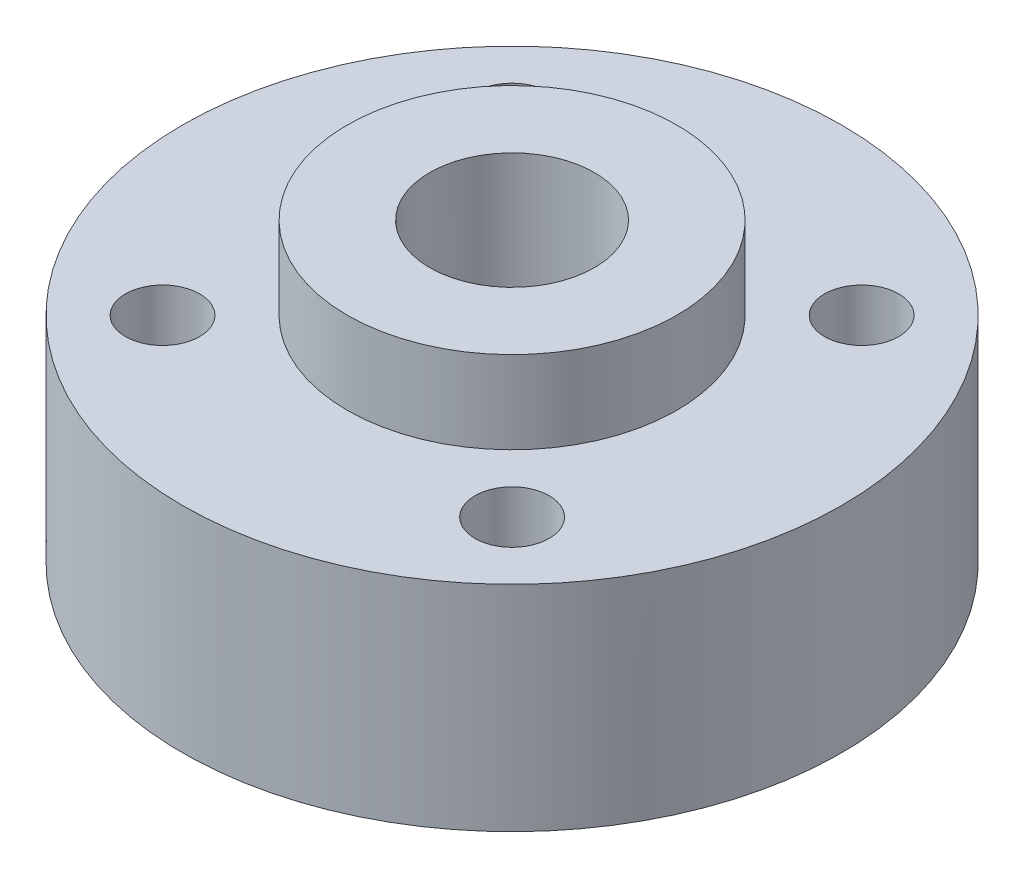
ISO-10303-21;
HEADER;
FILE_DESCRIPTION(('STEP AP214'),'2;1');
FILE_NAME('part.step','',(''),(''),'','','');
FILE_SCHEMA(('AUTOMOTIVE_DESIGN { 1 0 10303 214 1 1 1 1 }'));
ENDSEC;
DATA;
#1=APPLICATION_CONTEXT('core data for automotive mechanical design processes');
#2=APPLICATION_PROTOCOL_DEFINITION('international standard','automotive_design',2000,#1);
#3=PRODUCT_CONTEXT('',#1,'mechanical');
#4=PRODUCT('Part','Part','',(#3));
#5=PRODUCT_RELATED_PRODUCT_CATEGORY('part','',(#4));
#6=PRODUCT_DEFINITION_FORMATION('','',#4);
#7=PRODUCT_DEFINITION_CONTEXT('part definition',#1,'design');
#8=PRODUCT_DEFINITION('design','',#6,#7);
#9=PRODUCT_DEFINITION_SHAPE('','',#8);
#10=(LENGTH_UNIT() NAMED_UNIT(*) SI_UNIT(.MILLI.,.METRE.));
#11=(NAMED_UNIT(*) PLANE_ANGLE_UNIT() SI_UNIT($,.RADIAN.));
#12=(NAMED_UNIT(*) SI_UNIT($,.STERADIAN.) SOLID_ANGLE_UNIT());
#13=UNCERTAINTY_MEASURE_WITH_UNIT(LENGTH_MEASURE(1.E-05),#10,'distance_accuracy_value','');
#14=(GEOMETRIC_REPRESENTATION_CONTEXT(3) GLOBAL_UNCERTAINTY_ASSIGNED_CONTEXT((#13)) GLOBAL_UNIT_ASSIGNED_CONTEXT((#10,
#11,#12)) REPRESENTATION_CONTEXT('',''));
#15=CARTESIAN_POINT('',(0.,0.,0.));
#16=DIRECTION('',(0.,0.,1.));
#17=DIRECTION('',(1.,0.,0.));
#18=AXIS2_PLACEMENT_3D('',#15,#16,#17);
#19=CARTESIAN_POINT('',(0.,7.5,0.));
#20=DIRECTION('',(0.,1.,0.));
#21=DIRECTION('',(0.,0.,1.));
#22=AXIS2_PLACEMENT_3D('',#19,#20,#21);
#23=PLANE('',#22);
#24=CARTESIAN_POINT('',(0.,7.5,0.));
#25=DIRECTION('',(0.,1.,0.));
#26=DIRECTION('',(0.,0.,1.));
#27=AXIS2_PLACEMENT_3D('',#24,#25,#26);
#28=CIRCLE('',#27,20.);
#29=CARTESIAN_POINT('',(0.,7.5,20.));
#30=VERTEX_POINT('',#29);
#31=EDGE_CURVE('E10',#30,#30,#28,.T.);
#32=ORIENTED_EDGE('',*,*,#31,.T.);
#33=EDGE_LOOP('',(#32));
#34=FACE_BOUND('',#33,.T.);
#35=CARTESIAN_POINT('',(-10.6066017177982,7.5,-10.6066017177982));
#36=DIRECTION('',(0.,1.,0.));
#37=DIRECTION('',(0.,0.,1.));
#38=AXIS2_PLACEMENT_3D('',#35,#36,#37);
#39=CIRCLE('',#38,2.25);
#40=CARTESIAN_POINT('',(-10.6066017177982,7.5,-8.35660171779819));
#41=VERTEX_POINT('',#40);
#42=EDGE_CURVE('E88',#41,#41,#39,.T.);
#43=ORIENTED_EDGE('',*,*,#42,.F.);
#44=EDGE_LOOP('',(#43));
#45=FACE_BOUND('',#44,.T.);
#46=CARTESIAN_POINT('',(10.6066017177981,7.5,-10.6066017177983));
#47=DIRECTION('',(0.,1.,0.));
#48=DIRECTION('',(-1.,0.,0.));
#49=AXIS2_PLACEMENT_3D('',#46,#47,#48);
#50=CIRCLE('',#49,2.25);
#51=CARTESIAN_POINT('',(8.35660171779808,7.5,-10.6066017177983));
#52=VERTEX_POINT('',#51);
#53=EDGE_CURVE('E81',#52,#52,#50,.T.);
#54=ORIENTED_EDGE('',*,*,#53,.F.);
#55=EDGE_LOOP('',(#54));
#56=FACE_BOUND('',#55,.T.);
#57=CARTESIAN_POINT('',(10.6066017177982,7.5,10.6066017177982));
#58=DIRECTION('',(0.,1.,0.));
#59=DIRECTION('',(0.,0.,-1.));
#60=AXIS2_PLACEMENT_3D('',#57,#58,#59);
#61=CIRCLE('',#60,2.25);
#62=CARTESIAN_POINT('',(10.6066017177982,7.5,8.35660171779819));
#63=VERTEX_POINT('',#62);
#64=EDGE_CURVE('E95',#63,#63,#61,.T.);
#65=ORIENTED_EDGE('',*,*,#64,.F.);
#66=EDGE_LOOP('',(#65));
#67=FACE_BOUND('',#66,.T.);
#68=CARTESIAN_POINT('',(-10.6066017177982,7.5,10.6066017177983));
#69=DIRECTION('',(0.,1.,0.));
#70=DIRECTION('',(1.,0.,0.));
#71=AXIS2_PLACEMENT_3D('',#68,#69,#70);
#72=CIRCLE('',#71,2.25);
#73=CARTESIAN_POINT('',(-8.35660171779816,7.5,10.6066017177983));
#74=VERTEX_POINT('',#73);
#75=EDGE_CURVE('E89',#74,#74,#72,.T.);
#76=ORIENTED_EDGE('',*,*,#75,.F.);
#77=EDGE_LOOP('',(#76));
#78=FACE_BOUND('',#77,.T.);
#79=CARTESIAN_POINT('',(0.,7.5,0.));
#80=DIRECTION('',(0.,1.,0.));
#81=DIRECTION('',(0.,0.,1.));
#82=AXIS2_PLACEMENT_3D('',#79,#80,#81);
#83=CIRCLE('',#82,10.);
#84=CARTESIAN_POINT('',(0.,7.5,10.));
#85=VERTEX_POINT('',#84);
#86=EDGE_CURVE('E120',#85,#85,#83,.T.);
#87=ORIENTED_EDGE('',*,*,#86,.F.);
#88=EDGE_LOOP('',(#87));
#89=FACE_BOUND('',#88,.T.);
#90=ADVANCED_FACE('F30',(#34,#45,#56,#67,#78,#89),#23,.T.);
#91=CARTESIAN_POINT('',(0.,-7.5,0.));
#92=DIRECTION('',(0.,1.,0.));
#93=DIRECTION('',(0.,0.,1.));
#94=AXIS2_PLACEMENT_3D('',#91,#92,#93);
#95=PLANE('',#94);
#96=CARTESIAN_POINT('',(0.,-7.5,0.));
#97=DIRECTION('',(0.,1.,0.));
#98=DIRECTION('',(0.,0.,1.));
#99=AXIS2_PLACEMENT_3D('',#96,#97,#98);
#100=CIRCLE('',#99,5.);
#101=CARTESIAN_POINT('',(0.,-7.5,5.));
#102=VERTEX_POINT('',#101);
#103=EDGE_CURVE('E39',#102,#102,#100,.T.);
#104=ORIENTED_EDGE('',*,*,#103,.T.);
#105=EDGE_LOOP('',(#104));
#106=FACE_BOUND('',#105,.T.);
#107=CARTESIAN_POINT('',(0.,-7.5,0.));
#108=DIRECTION('',(0.,-1.,0.));
#109=DIRECTION('',(0.,0.,-1.));
#110=AXIS2_PLACEMENT_3D('',#107,#108,#109);
#111=CIRCLE('',#110,10.);
#112=CARTESIAN_POINT('',(0.,-7.5,-10.));
#113=VERTEX_POINT('',#112);
#114=EDGE_CURVE('E126',#113,#113,#111,.T.);
#115=ORIENTED_EDGE('',*,*,#114,.T.);
#116=EDGE_LOOP('',(#115));
#117=FACE_BOUND('',#116,.T.);
#118=ADVANCED_FACE('F111',(#106,#117),#95,.F.);
#119=CARTESIAN_POINT('',(0.,7.5,0.));
#120=DIRECTION('',(0.,-1.,0.));
#121=DIRECTION('',(0.,0.,-1.));
#122=AXIS2_PLACEMENT_3D('',#119,#120,#121);
#123=CYLINDRICAL_SURFACE('',#122,20.);
#124=ORIENTED_EDGE('',*,*,#31,.F.);
#125=EDGE_LOOP('',(#124));
#126=FACE_BOUND('',#125,.T.);
#127=CARTESIAN_POINT('',(0.,2.25,-20.));
#128=CARTESIAN_POINT('',(-0.12595653422754,2.24999459165418,-19.9999983916896));
#129=CARTESIAN_POINT('',(-0.251994190121903,2.23938766603984,-19.9987975140792));
#130=CARTESIAN_POINT('',(-0.500569129819927,2.19723813548911,-19.9941224661232));
#131=CARTESIAN_POINT('',(-0.623102504576185,2.16567303420946,-19.9906458530775));
#132=CARTESIAN_POINT('',(-0.861033738412179,2.08254301798447,-19.98181140957));
#133=CARTESIAN_POINT('',(-0.976436087007576,2.03099083824956,-19.9764547772098));
#134=CARTESIAN_POINT('',(-1.19692694189212,1.90937629489067,-19.964457745396));
#135=CARTESIAN_POINT('',(-1.3020173604729,1.8393173721729,-19.9578175846468));
#136=CARTESIAN_POINT('',(-1.49939790756792,1.68234029759234,-19.9439627363684));
#137=CARTESIAN_POINT('',(-1.59163499909242,1.59535564531887,-19.9367458510751));
#138=CARTESIAN_POINT('',(-1.76023429925169,1.40713868555006,-19.9225688974834));
#139=CARTESIAN_POINT('',(-1.83659573935264,1.30590568869578,-19.9156088416313));
#140=CARTESIAN_POINT('',(-1.97146895296656,1.09172718781443,-19.9027116079686));
#141=CARTESIAN_POINT('',(-2.02993186891103,0.978750732715221,-19.896777248869));
#142=CARTESIAN_POINT('',(-2.12703651216175,0.744506032493647,-19.8866315278854));
#143=CARTESIAN_POINT('',(-2.16567885208601,0.623238043778851,-19.882420112749));
#144=CARTESIAN_POINT('',(-2.22188616663361,0.376398638788323,-19.8762176047277));
#145=CARTESIAN_POINT('',(-2.23953995188614,0.250847684438009,-19.8742171589324));
#146=CARTESIAN_POINT('',(-2.25354369576188,-0.00144973877291306,-19.872634280748));
#147=CARTESIAN_POINT('',(-2.24989435414666,-0.128196168228214,-19.8730517689351));
#148=CARTESIAN_POINT('',(-2.22146849070042,-0.378671308449509,-19.8762490345589));
#149=CARTESIAN_POINT('',(-2.19678934102239,-0.502411228380636,-19.879017924342));
#150=CARTESIAN_POINT('',(-2.1271561175811,-0.743981836045423,-19.8865890205414));
#151=CARTESIAN_POINT('',(-2.08220170484526,-0.861812424947161,-19.8913912609523));
#152=CARTESIAN_POINT('',(-1.97318790208164,-1.08852478132344,-19.9025004195946));
#153=CARTESIAN_POINT('',(-1.90908573138459,-1.19738580637386,-19.9088107007699));
#154=CARTESIAN_POINT('',(-1.76362671110957,-1.40284174421491,-19.9222222173786));
#155=CARTESIAN_POINT('',(-1.68226922194342,-1.49943620211893,-19.9293234821262));
#156=CARTESIAN_POINT('',(-1.50406714512458,-1.67818256707793,-19.9435653095352));
#157=CARTESIAN_POINT('',(-1.40713854088213,-1.7602507368131,-19.9507058700096));
#158=CARTESIAN_POINT('',(-1.20083625225702,-1.90696448435295,-19.9641844277881));
#159=CARTESIAN_POINT('',(-1.09146254766764,-1.97161003386849,-19.970522423789));
#160=CARTESIAN_POINT('',(-0.86331365850418,-2.08164174517799,-19.9816846488748));
#161=CARTESIAN_POINT('',(-0.74453617914061,-2.12702318868538,-19.986508507032));
#162=CARTESIAN_POINT('',(-0.5009808307105,-2.19717469974177,-19.994095382619));
#163=CARTESIAN_POINT('',(-0.376203189127312,-2.22194554804684,-19.9968584781127));
#164=CARTESIAN_POINT('',(-0.124914122086498,-2.25006539878771,-20.000002422939));
#165=CARTESIAN_POINT('',(0.00158422939712101,-2.25352985771116,-20.0003961115233));
#166=CARTESIAN_POINT('',(0.253359714887554,-2.23924251414208,-19.998791425042));
#167=CARTESIAN_POINT('',(0.378636869829028,-2.22149107599537,-19.9967930910553));
#168=CARTESIAN_POINT('',(0.624077049682717,-2.16537168696439,-19.9906369945286));
#169=CARTESIAN_POINT('',(0.74425269794097,-2.12705826495014,-19.9864849444559));
#170=CARTESIAN_POINT('',(0.976472099187427,-2.03095883128837,-19.9764867440531));
#171=CARTESIAN_POINT('',(1.08851562463143,-1.97317227501991,-19.9706405463419));
#172=CARTESIAN_POINT('',(1.30180928914228,-1.8394838971492,-19.9578749174881));
#173=CARTESIAN_POINT('',(1.40301196039062,-1.76350677172692,-19.9509510680054));
#174=CARTESIAN_POINT('',(1.59126949406033,-1.59570125570931,-19.9368199725166));
#175=CARTESIAN_POINT('',(1.67832390452276,-1.50387235893042,-19.9296127174665));
#176=CARTESIAN_POINT('',(1.83621879743148,-1.30646390591937,-19.9156880079027));
#177=CARTESIAN_POINT('',(1.90698314176443,-1.20082325826826,-19.9089729495644));
#178=CARTESIAN_POINT('',(2.02976454018774,-0.979089053883812,-19.8968308698045));
#179=CARTESIAN_POINT('',(2.08178190837407,-0.862995672321404,-19.8914038268034));
#180=CARTESIAN_POINT('',(2.16546728299968,-0.623905260887279,-19.8824679266496));
#181=CARTESIAN_POINT('',(2.19717946602248,-0.500923855589978,-19.8789549077887));
#182=CARTESIAN_POINT('',(2.23949713178096,-0.251339905733451,-19.8742323958419));
#183=CARTESIAN_POINT('',(2.250103396302,-0.124737495476262,-19.8730228174341));
#184=CARTESIAN_POINT('',(2.24989565842773,0.127737640010851,-19.8730462777696));
#185=CARTESIAN_POINT('',(2.23920125785514,0.253610481841064,-19.8742656779627));
#186=CARTESIAN_POINT('',(2.19694771835504,0.501758474941963,-19.8789805075552));
#187=CARTESIAN_POINT('',(2.16538856505871,0.624033623734983,-19.882475938522));
#188=CARTESIAN_POINT('',(2.08233649924143,0.861507280631521,-19.8913449966611));
#189=CARTESIAN_POINT('',(2.03084818053867,0.976707412492701,-19.8967181909675));
#190=CARTESIAN_POINT('',(1.90941130191561,1.19685077880024,-19.9087381590707));
#191=CARTESIAN_POINT('',(1.83946268594876,1.30179398210462,-19.9153849367341));
#192=CARTESIAN_POINT('',(1.68264381218864,1.49905700988164,-19.9292478989181));
#193=CARTESIAN_POINT('',(1.59568433965112,1.59130571212968,-19.936466960647));
#194=CARTESIAN_POINT('',(1.40749468127853,1.75995013727221,-19.950635162213));
#195=CARTESIAN_POINT('',(1.30626110896857,1.83634208755078,-19.9575842374964));
#196=CARTESIAN_POINT('',(1.09204274654609,1.97130007089213,-19.9704527625105));
#197=CARTESIAN_POINT('',(0.979022359287405,2.02980987711342,-19.9763689399996));
#198=CARTESIAN_POINT('',(0.744761992830465,2.12693976233983,-19.9864708944833));
#199=CARTESIAN_POINT('',(0.623531292595019,2.1655818840901,-19.9906585881692));
#200=CARTESIAN_POINT('',(0.418034465927811,2.21242530738788,-19.9957995892954));
#201=CARTESIAN_POINT('',(0.33507403916056,2.22649609794949,-19.9973672439623));
#202=CARTESIAN_POINT('',(0.168087781707914,2.2452852229585,-19.999467983119));
#203=CARTESIAN_POINT('',(0.0840619569559497,2.25000360946843,-20.0000010733681));
#204=CARTESIAN_POINT('',(0.,2.25,-20.));
#205=B_SPLINE_CURVE_WITH_KNOTS('',3,(#127,#128,#129,#130,#131,#132,#133,#134,#135,#136,#137,
#138,#139,#140,#141,#142,#143,#144,#145,#146,#147,#148,#149,#150,#151,#152,#153,#154,#155,#156,
#157,#158,#159,#160,#161,#162,#163,#164,#165,#166,#167,#168,#169,#170,#171,#172,#173,#174,#175,
#176,#177,#178,#179,#180,#181,#182,#183,#184,#185,#186,#187,#188,#189,#190,#191,#192,#193,#194,
#195,#196,#197,#198,#199,#200,#201,#202,#203,#204),.UNSPECIFIED.,.T.,.F.,(4,2,2,2,2,2,2,2,2,2,2,
2,2,2,2,2,2,2,2,2,2,2,2,2,2,2,2,2,2,2,2,2,2,2,2,2,2,2,4),(0.,0.377562598674401,
0.755531126712053,1.13325921846395,1.51091712967437,1.89008994631748,2.26928111429069,
2.64949831582188,3.02970376482131,3.40829462693554,3.78687305322994,4.16370805251873,
4.54054935216792,4.9182389843696,5.29594261851797,5.67575725262566,6.05557250343523,
6.43548072739601,6.81537455928535,7.19320797007885,7.57103489233969,7.94786476098357,
8.32470516960885,8.70313341812505,9.08157375296244,9.46174850655045,9.84191689020943,
10.221255331996,10.6005797224272,10.9777802356733,11.3549810086843,11.7320948858927,
12.1092099080543,12.488358495692,12.8675971866894,13.2480163330257,13.628012497197,
13.879994879813,14.1319758597009),.UNSPECIFIED.);
#206=CARTESIAN_POINT('',(0.,2.25,-20.));
#207=VERTEX_POINT('',#206);
#208=EDGE_CURVE('E54',#207,#207,#205,.T.);
#209=ORIENTED_EDGE('',*,*,#208,.T.);
#210=EDGE_LOOP('',(#209));
#211=FACE_BOUND('',#210,.T.);
#212=CARTESIAN_POINT('',(-20.0000000000001,-2.25,0.));
#213=CARTESIAN_POINT('',(-19.9999983916897,-2.24999459165418,-0.125956534227469));
#214=CARTESIAN_POINT('',(-19.9987975140793,-2.23938766603984,-0.251994190121832));
#215=CARTESIAN_POINT('',(-19.9941224661232,-2.19723813548911,-0.500569129819856));
#216=CARTESIAN_POINT('',(-19.9906458530775,-2.16567303420946,-0.623102504576114));
#217=CARTESIAN_POINT('',(-19.98181140957,-2.08254301798448,-0.861033738412108));
#218=CARTESIAN_POINT('',(-19.9764547772098,-2.03099083824956,-0.976436087007505));
#219=CARTESIAN_POINT('',(-19.964457745396,-1.90937629489067,-1.19692694189204));
#220=CARTESIAN_POINT('',(-19.9578175846468,-1.8393173721729,-1.30201736047283));
#221=CARTESIAN_POINT('',(-19.9439627363684,-1.68234029759234,-1.49939790756785));
#222=CARTESIAN_POINT('',(-19.9367458510751,-1.59535564531887,-1.59163499909235));
#223=CARTESIAN_POINT('',(-19.9225688974834,-1.40713868555006,-1.76023429925162));
#224=CARTESIAN_POINT('',(-19.9156088416313,-1.30590568869579,-1.83659573935257));
#225=CARTESIAN_POINT('',(-19.9027116079686,-1.09172718781444,-1.97146895296649));
#226=CARTESIAN_POINT('',(-19.896777248869,-0.978750732715224,-2.02993186891096));
#227=CARTESIAN_POINT('',(-19.8866315278854,-0.744506032493649,-2.12703651216168));
#228=CARTESIAN_POINT('',(-19.882420112749,-0.623238043778853,-2.16567885208594));
#229=CARTESIAN_POINT('',(-19.8762176047278,-0.376398638788325,-2.22188616663354));
#230=CARTESIAN_POINT('',(-19.8742171589324,-0.250847684438011,-2.23953995188607));
#231=CARTESIAN_POINT('',(-19.872634280748,0.00144973877291076,-2.25354369576181));
#232=CARTESIAN_POINT('',(-19.8730517689351,0.128196168228212,-2.24989435414659));
#233=CARTESIAN_POINT('',(-19.8762490345589,0.378671308449506,-2.22146849070035));
#234=CARTESIAN_POINT('',(-19.879017924342,0.502411228380634,-2.19678934102232));
#235=CARTESIAN_POINT('',(-19.8865890205414,0.743981836045421,-2.12715611758103));
#236=CARTESIAN_POINT('',(-19.8913912609523,0.861812424947159,-2.08220170484519));
#237=CARTESIAN_POINT('',(-19.9025004195946,1.08852478132344,-1.97318790208157));
#238=CARTESIAN_POINT('',(-19.9088107007699,1.19738580637386,-1.90908573138452));
#239=CARTESIAN_POINT('',(-19.9222222173787,1.40284174421491,-1.7636267111095));
#240=CARTESIAN_POINT('',(-19.9293234821262,1.49943620211893,-1.68226922194335));
#241=CARTESIAN_POINT('',(-19.9435653095352,1.67818256707792,-1.50406714512451));
#242=CARTESIAN_POINT('',(-19.9507058700096,1.7602507368131,-1.40713854088206));
#243=CARTESIAN_POINT('',(-19.9641844277881,1.90696448435295,-1.20083625225695));
#244=CARTESIAN_POINT('',(-19.9705224237891,1.97161003386849,-1.09146254766757));
#245=CARTESIAN_POINT('',(-19.9816846488748,2.08164174517799,-0.863313658504113));
#246=CARTESIAN_POINT('',(-19.986508507032,2.12702318868538,-0.744536179140543));
#247=CARTESIAN_POINT('',(-19.994095382619,2.19717469974177,-0.500980830710433));
#248=CARTESIAN_POINT('',(-19.9968584781127,2.22194554804684,-0.376203189127246));
#249=CARTESIAN_POINT('',(-20.000002422939,2.25006539878771,-0.124914122086431));
#250=CARTESIAN_POINT('',(-20.0003961115233,2.25352985771116,0.00158422939718775));
#251=CARTESIAN_POINT('',(-19.998791425042,2.23924251414208,0.253359714887621));
#252=CARTESIAN_POINT('',(-19.9967930910553,2.22149107599537,0.378636869829094));
#253=CARTESIAN_POINT('',(-19.9906369945286,2.16537168696439,0.624077049682784));
#254=CARTESIAN_POINT('',(-19.9864849444559,2.12705826495014,0.744252697941036));
#255=CARTESIAN_POINT('',(-19.9764867440531,2.03095883128837,0.976472099187494));
#256=CARTESIAN_POINT('',(-19.9706405463419,1.97317227501991,1.08851562463149));
#257=CARTESIAN_POINT('',(-19.9578749174881,1.8394838971492,1.30180928914235));
#258=CARTESIAN_POINT('',(-19.9509510680054,1.76350677172692,1.40301196039069));
#259=CARTESIAN_POINT('',(-19.9368199725166,1.59570125570931,1.5912694940604));
#260=CARTESIAN_POINT('',(-19.9296127174665,1.50387235893042,1.67832390452283));
#261=CARTESIAN_POINT('',(-19.9156880079027,1.30646390591937,1.83621879743155));
#262=CARTESIAN_POINT('',(-19.9089729495644,1.20082325826826,1.9069831417645));
#263=CARTESIAN_POINT('',(-19.8968308698045,0.979089053883815,2.02976454018781));
#264=CARTESIAN_POINT('',(-19.8914038268034,0.862995672321407,2.08178190837414));
#265=CARTESIAN_POINT('',(-19.8824679266495,0.623905260887282,2.16546728299975));
#266=CARTESIAN_POINT('',(-19.8789549077887,0.500923855589981,2.19717946602255));
#267=CARTESIAN_POINT('',(-19.8742323958419,0.251339905733455,2.23949713178103));
#268=CARTESIAN_POINT('',(-19.8730228174341,0.124737495476265,2.25010339630207));
#269=CARTESIAN_POINT('',(-19.8730462777696,-0.127737640010847,2.2498956584278));
#270=CARTESIAN_POINT('',(-19.8742656779627,-0.25361048184106,2.23920125785521));
#271=CARTESIAN_POINT('',(-19.8789805075552,-0.501758474941959,2.19694771835511));
#272=CARTESIAN_POINT('',(-19.882475938522,-0.624033623734979,2.16538856505878));
#273=CARTESIAN_POINT('',(-19.8913449966611,-0.861507280631518,2.0823364992415));
#274=CARTESIAN_POINT('',(-19.8967181909675,-0.976707412492698,2.03084818053874));
#275=CARTESIAN_POINT('',(-19.9087381590707,-1.19685077880023,1.90941130191568));
#276=CARTESIAN_POINT('',(-19.9153849367341,-1.30179398210462,1.83946268594883));
#277=CARTESIAN_POINT('',(-19.9292478989181,-1.49905700988164,1.68264381218871));
#278=CARTESIAN_POINT('',(-19.936466960647,-1.59130571212968,1.59568433965119));
#279=CARTESIAN_POINT('',(-19.950635162213,-1.75995013727221,1.4074946812786));
#280=CARTESIAN_POINT('',(-19.9575842374963,-1.83634208755077,1.30626110896864));
#281=CARTESIAN_POINT('',(-19.9704527625105,-1.97130007089212,1.09204274654616));
#282=CARTESIAN_POINT('',(-19.9763689399996,-2.02980987711342,0.979022359287478));
#283=CARTESIAN_POINT('',(-19.9864708944833,-2.12693976233983,0.744761992830538));
#284=CARTESIAN_POINT('',(-19.9906585881692,-2.1655818840901,0.623531292595092));
#285=CARTESIAN_POINT('',(-19.9957995892954,-2.21242530738788,0.418034465927883));
#286=CARTESIAN_POINT('',(-19.9973672439622,-2.22649609794949,0.33507403916063));
#287=CARTESIAN_POINT('',(-19.999467983119,-2.2452852229585,0.168087781707984));
#288=CARTESIAN_POINT('',(-20.0000010733681,-2.25000360946843,0.0840619569560193));
#289=CARTESIAN_POINT('',(-20.0000000000001,-2.25,0.));
#290=B_SPLINE_CURVE_WITH_KNOTS('',3,(#212,#213,#214,#215,#216,#217,#218,#219,#220,#221,#222,
#223,#224,#225,#226,#227,#228,#229,#230,#231,#232,#233,#234,#235,#236,#237,#238,#239,#240,#241,
#242,#243,#244,#245,#246,#247,#248,#249,#250,#251,#252,#253,#254,#255,#256,#257,#258,#259,#260,
#261,#262,#263,#264,#265,#266,#267,#268,#269,#270,#271,#272,#273,#274,#275,#276,#277,#278,#279,
#280,#281,#282,#283,#284,#285,#286,#287,#288,#289),.UNSPECIFIED.,.T.,.F.,(4,2,2,2,2,2,2,2,2,2,2,
2,2,2,2,2,2,2,2,2,2,2,2,2,2,2,2,2,2,2,2,2,2,2,2,2,2,2,4),(0.,0.3775625986744,0.755531126712053,
1.13325921846394,1.51091712967437,1.89008994631747,2.26928111429069,2.64949831582188,
3.02970376482131,3.40829462693554,3.78687305322994,4.16370805251873,4.54054935216792,
4.9182389843696,5.29594261851796,5.67575725262566,6.05557250343523,6.435480727396,
6.81537455928534,7.19320797007885,7.57103489233969,7.94786476098357,8.32470516960885,
8.70313341812505,9.08157375296244,9.46174850655044,9.84191689020943,10.221255331996,
10.6005797224272,10.9777802356732,11.3549810086843,11.7320948858927,12.1092099080543,
12.488358495692,12.8675971866894,13.2480163330257,13.628012497197,13.879994879813,
14.1319758597009),.UNSPECIFIED.);
#291=CARTESIAN_POINT('',(-20.0000000000001,-2.25,0.));
#292=VERTEX_POINT('',#291);
#293=EDGE_CURVE('E55',#292,#292,#290,.T.);
#294=ORIENTED_EDGE('',*,*,#293,.T.);
#295=EDGE_LOOP('',(#294));
#296=FACE_BOUND('',#295,.T.);
#297=CARTESIAN_POINT('',(0.,-5.5,0.));
#298=DIRECTION('',(0.,-1.,0.));
#299=DIRECTION('',(0.,0.,-1.));
#300=AXIS2_PLACEMENT_3D('',#297,#298,#299);
#301=CIRCLE('',#300,20.);
#302=CARTESIAN_POINT('',(0.,-5.5,-20.));
#303=VERTEX_POINT('',#302);
#304=EDGE_CURVE('E35',#303,#303,#301,.T.);
#305=ORIENTED_EDGE('',*,*,#304,.F.);
#306=EDGE_LOOP('',(#305));
#307=FACE_BOUND('',#306,.T.);
#308=ADVANCED_FACE('F32',(#126,#211,#296,#307),#123,.T.);
#309=CARTESIAN_POINT('',(0.,7.5,0.));
#310=DIRECTION('',(0.,-1.,0.));
#311=DIRECTION('',(0.,0.,-1.));
#312=AXIS2_PLACEMENT_3D('',#309,#310,#311);
#313=CYLINDRICAL_SURFACE('',#312,5.);
#314=CARTESIAN_POINT('',(-4.46514277487295,0.,-2.24999999999998));
#315=CARTESIAN_POINT('',(-4.46515039872744,0.118961212730899,-2.24999304031582));
#316=CARTESIAN_POINT('',(-4.46996667268981,0.23811478026112,-2.24050444334662));
#317=CARTESIAN_POINT('',(-4.48857891323593,0.472898171502685,-2.2029695202572));
#318=CARTESIAN_POINT('',(-4.50239729083485,0.58851844487727,-2.17487687588998));
#319=CARTESIAN_POINT('',(-4.53710585458753,0.812415971455815,-2.10149811494294));
#320=CARTESIAN_POINT('',(-4.55796389692776,0.920723962715011,-2.05629003690714));
#321=CARTESIAN_POINT('',(-4.60435303457611,1.12819075498199,-1.95019826041787));
#322=CARTESIAN_POINT('',(-4.62988356005072,1.22735066942954,-1.88931647308659));
#323=CARTESIAN_POINT('',(-4.68481687387391,1.42098476899268,-1.7488668244811));
#324=CARTESIAN_POINT('',(-4.71436409953234,1.51471493678868,-1.66832919766813));
#325=CARTESIAN_POINT('',(-4.77282391954204,1.68789907635393,-1.49288314705883));
#326=CARTESIAN_POINT('',(-4.80173623973545,1.76734698333833,-1.39796864967687));
#327=CARTESIAN_POINT('',(-4.85747480215182,1.91373579944624,-1.19040340238109));
#328=CARTESIAN_POINT('',(-4.88411395697376,1.97980975431491,-1.07708634932838));
#329=CARTESIAN_POINT('',(-4.93049745168419,2.09162698097508,-0.839526009772603));
#330=CARTESIAN_POINT('',(-4.95024533600557,2.13738070751653,-0.715288381409364));
#331=CARTESIAN_POINT('',(-4.97959116820759,2.20446872819457,-0.467253632116459));
#332=CARTESIAN_POINT('',(-4.98972320525301,2.22709419450187,-0.343870281116708));
#333=CARTESIAN_POINT('',(-5.00065622282591,2.25148606134454,-0.0946715176300191));
#334=CARTESIAN_POINT('',(-5.00146166644926,2.2532624388918,0.0311427027271594));
#335=CARTESIAN_POINT('',(-4.99394241822246,2.23651538504021,0.272124930597757));
#336=CARTESIAN_POINT('',(-4.98625984599743,2.21941970526708,0.387416232492536));
#337=CARTESIAN_POINT('',(-4.96354367577184,2.16790181481508,0.613288459239073));
#338=CARTESIAN_POINT('',(-4.94850953297701,2.13347832003844,0.72386903433816));
#339=CARTESIAN_POINT('',(-4.91222614034771,2.04792194942413,0.939228995401056));
#340=CARTESIAN_POINT('',(-4.89088595660149,1.99654321346537,1.04389475376016));
#341=CARTESIAN_POINT('',(-4.84401587857545,1.87880370487183,1.24339321925696));
#342=CARTESIAN_POINT('',(-4.81848445331244,1.8124374542342,1.33822231250922));
#343=CARTESIAN_POINT('',(-4.76331481407975,1.66044416427961,1.52345175293303));
#344=CARTESIAN_POINT('',(-4.73351145466937,1.57369917664996,1.61288673432275));
#345=CARTESIAN_POINT('',(-4.67460929075157,1.38649269946707,1.77639992608748));
#346=CARTESIAN_POINT('',(-4.64551086115729,1.28602409178984,1.85047011655519));
#347=CARTESIAN_POINT('',(-4.59001891824127,1.06876432447167,1.98423981017752));
#348=CARTESIAN_POINT('',(-4.56379860249299,0.951452562996041,2.04317215242968));
#349=CARTESIAN_POINT('',(-4.51919374197596,0.707085952905828,2.14003834281191));
#350=CARTESIAN_POINT('',(-4.50080253313332,0.580039499530957,2.17799005773758));
#351=CARTESIAN_POINT('',(-4.4756770601738,0.329506261178266,2.22914248632391));
#352=CARTESIAN_POINT('',(-4.46820077828806,0.206418619368719,2.24392437246761));
#353=CARTESIAN_POINT('',(-4.46362263539942,-0.0406793100698386,2.25302242470035));
#354=CARTESIAN_POINT('',(-4.46651605832116,-0.164689152686053,2.24734789422981));
#355=CARTESIAN_POINT('',(-4.48157509018497,-0.399600164876354,2.21714216163571));
#356=CARTESIAN_POINT('',(-4.49297960430385,-0.510755809778822,2.19415743855623));
#357=CARTESIAN_POINT('',(-4.52274424903302,-0.727499654595559,2.13212542419368));
#358=CARTESIAN_POINT('',(-4.54110619860307,-0.833086390337139,2.09307393216708));
#359=CARTESIAN_POINT('',(-4.58371481317642,-1.04104817077916,1.99809284583431));
#360=CARTESIAN_POINT('',(-4.60818960972127,-1.14306336494584,1.94148122987607));
#361=CARTESIAN_POINT('',(-4.65998955680978,-1.33668361382085,1.81362927889097));
#362=CARTESIAN_POINT('',(-4.68731606376624,-1.42828367089954,1.74238196666511));
#363=CARTESIAN_POINT('',(-4.74496334454853,-1.60782553793588,1.57908877421525));
#364=CARTESIAN_POINT('',(-4.77531541652933,-1.69453189515696,1.48568977503589));
#365=CARTESIAN_POINT('',(-4.83317624810729,-1.85132654391102,1.28502997436726));
#366=CARTESIAN_POINT('',(-4.86068456021687,-1.92141222229023,1.17776699723163));
#367=CARTESIAN_POINT('',(-4.91017542897077,-2.04339614149589,0.950682209086063));
#368=CARTESIAN_POINT('',(-4.93210022008002,-2.09510628237482,0.830745952505911));
#369=CARTESIAN_POINT('',(-4.96751583574373,-2.17717624887848,0.582619539391244));
#370=CARTESIAN_POINT('',(-4.98101260572729,-2.20755112705711,0.454435271872233));
#371=CARTESIAN_POINT('',(-4.99726613498169,-2.24397104157032,0.204394813787142));
#372=CARTESIAN_POINT('',(-5.00078768109045,-2.25174983493317,0.082839608664378));
#373=CARTESIAN_POINT('',(-4.99891579804308,-2.24759119114143,-0.159848279708566));
#374=CARTESIAN_POINT('',(-4.99352443536979,-2.23565832419094,-0.280981054375432));
#375=CARTESIAN_POINT('',(-4.97486307031119,-2.19364763166515,-0.513549488452849));
#376=CARTESIAN_POINT('',(-4.96196940870592,-2.16443550344393,-0.625174452755531));
#377=CARTESIAN_POINT('',(-4.92983796875448,-2.08972166233701,-0.841845251095426));
#378=CARTESIAN_POINT('',(-4.9105990976134,-2.04421714340131,-0.946889948144498));
#379=CARTESIAN_POINT('',(-4.86649288960106,-1.93592510905062,-1.15275170653519));
#380=CARTESIAN_POINT('',(-4.84140812281739,-1.87244147632884,-1.2531547875782));
#381=CARTESIAN_POINT('',(-4.78846161065104,-1.73094458141714,-1.44232456339339));
#382=CARTESIAN_POINT('',(-4.7605986704487,-1.65292505508211,-1.53108621316285));
#383=CARTESIAN_POINT('',(-4.70235094807989,-1.47716364752605,-1.70196716671106));
#384=CARTESIAN_POINT('',(-4.67194455656386,-1.37833667214088,-1.78296764783155));
#385=CARTESIAN_POINT('',(-4.61420006725823,-1.16773520063644,-1.9274929763214));
#386=CARTESIAN_POINT('',(-4.58686394862663,-1.05595244622327,-1.99100658915977));
#387=CARTESIAN_POINT('',(-4.53856864513168,-0.821151536184846,-2.09879543180336));
#388=CARTESIAN_POINT('',(-4.51764904631087,-0.698069490509973,-2.1429519296523));
#389=CARTESIAN_POINT('',(-4.49356898894665,-0.508545016244743,-2.19275164773713));
#390=CARTESIAN_POINT('',(-4.48676181351279,-0.44461510973914,-2.20660710269013));
#391=CARTESIAN_POINT('',(-4.47582163437335,-0.31558360284582,-2.2287167788832));
#392=CARTESIAN_POINT('',(-4.471686635247,-0.250482914154164,-2.23697517989219));
#393=CARTESIAN_POINT('',(-4.46770340658947,-0.154342335398334,-2.24491269447908));
#394=CARTESIAN_POINT('',(-4.46674464896162,-0.123514088630087,-2.24681915664302));
#395=CARTESIAN_POINT('',(-4.46546333269432,-0.0617948896693616,-2.24936373361877));
#396=CARTESIAN_POINT('',(-4.46514079433575,-0.0309039355093684,-2.25000180799795));
#397=CARTESIAN_POINT('',(-4.46514277487295,0.,-2.24999999999998));
#398=B_SPLINE_CURVE_WITH_KNOTS('',3,(#314,#315,#316,#317,#318,#319,#320,#321,#322,#323,#324,
#325,#326,#327,#328,#329,#330,#331,#332,#333,#334,#335,#336,#337,#338,#339,#340,#341,#342,#343,
#344,#345,#346,#347,#348,#349,#350,#351,#352,#353,#354,#355,#356,#357,#358,#359,#360,#361,#362,
#363,#364,#365,#366,#367,#368,#369,#370,#371,#372,#373,#374,#375,#376,#377,#378,#379,#380,#381,
#382,#383,#384,#385,#386,#387,#388,#389,#390,#391,#392,#393,#394,#395,#396,#397),.UNSPECIFIED.,
.T.,.F.,(4,2,2,2,2,2,2,2,2,2,2,2,2,2,2,2,2,2,2,2,2,2,2,2,2,2,2,2,2,2,2,2,2,2,2,2,2,2,2,2,2,4),
(0.,0.356759742987553,0.714411062073145,1.07045091984824,1.4264473856185,1.80599601944598,
2.18570544513355,2.58519198578237,2.98447275197118,3.35999219707463,3.73533193577185,
4.08410830185014,4.43291051821014,4.78701075889258,5.14124063485553,5.52388400014615,
5.90672659268635,6.30625734447515,6.70544733553703,7.0759816733518,7.44634751591088,
7.78705357899947,8.1278487781947,8.48402022975504,8.84036187276861,9.23157909435329,
9.62285778358306,10.0180336177098,10.412930364732,10.7766046049827,11.1401945381678,
11.4869501554105,11.8337655233701,12.1964652511595,12.5593216450042,12.9515422543472,
13.3440142630044,13.7388610212111,13.9359176589375,14.1328269760451,14.2255036426529,
14.318183263485),.UNSPECIFIED.);
#399=CARTESIAN_POINT('',(-4.46514277487295,0.,-2.24999999999998));
#400=VERTEX_POINT('',#399);
#401=EDGE_CURVE('E56',#400,#400,#398,.T.);
#402=ORIENTED_EDGE('',*,*,#401,.F.);
#403=EDGE_LOOP('',(#402));
#404=FACE_BOUND('',#403,.T.);
#405=CARTESIAN_POINT('',(0.,2.25,-5.));
#406=CARTESIAN_POINT('',(-0.119657163872058,2.24999415083253,-4.9999951803291));
#407=CARTESIAN_POINT('',(-0.239497209577401,2.24039855435601,-4.99565681806759));
#408=CARTESIAN_POINT('',(-0.47572081670771,2.20240049708451,-4.97873356251569));
#409=CARTESIAN_POINT('',(-0.592095550925141,2.1739536941356,-4.96612922657762));
#410=CARTESIAN_POINT('',(-0.817598389702704,2.09954173747306,-4.93401032574636));
#411=CARTESIAN_POINT('',(-0.926750955125896,2.05363969011045,-4.91452067131296));
#412=CARTESIAN_POINT('',(-1.13568251878513,1.94590630415095,-4.87048664392257));
#413=CARTESIAN_POINT('',(-1.23546350613327,1.88407835629123,-4.84594334714473));
#414=CARTESIAN_POINT('',(-1.42864166958965,1.74257025023733,-4.7926545488551));
#415=CARTESIAN_POINT('',(-1.52144083505235,1.66213152554666,-4.76375726911886));
#416=CARTESIAN_POINT('',(-1.69276142751265,1.48729760204052,-4.7056093324505));
#417=CARTESIAN_POINT('',(-1.77127412914542,1.3928939376057,-4.67635847112187));
#418=CARTESIAN_POINT('',(-1.91644184676257,1.18602120540544,-4.61884309478044));
#419=CARTESIAN_POINT('',(-1.98211224629651,1.07281109508273,-4.59074106078138));
#420=CARTESIAN_POINT('',(-2.09321326547296,0.83551854171932,-4.54116574662787));
#421=CARTESIAN_POINT('',(-2.13865597929338,0.711442648611196,-4.51968850785886));
#422=CARTESIAN_POINT('',(-2.2054422070107,0.462806781862004,-4.48746493874362));
#423=CARTESIAN_POINT('',(-2.22794402601262,0.338627175254946,-4.47620638732559));
#424=CARTESIAN_POINT('',(-2.25180742161623,0.0877845994371143,-4.46425372050826));
#425=CARTESIAN_POINT('',(-2.25318367120293,-0.0388765849386701,-4.46355227256902));
#426=CARTESIAN_POINT('',(-2.23561914182213,-0.278581941809458,-4.4723671338535));
#427=CARTESIAN_POINT('',(-2.2185407575292,-0.391804456728443,-4.48094689435861));
#428=CARTESIAN_POINT('',(-2.16771485945775,-0.613561976443885,-4.5057522601785));
#429=CARTESIAN_POINT('',(-2.13396347414753,-0.722095886160848,-4.52197964125844));
#430=CARTESIAN_POINT('',(-2.05008139659869,-0.934338665383906,-4.56062840437285));
#431=CARTESIAN_POINT('',(-1.99959732959401,-1.03788276499652,-4.58318164475399));
#432=CARTESIAN_POINT('',(-1.88393825005055,-1.23547409476085,-4.63192287969266));
#433=CARTESIAN_POINT('',(-1.81875698614686,-1.32951725902643,-4.65811241910162));
#434=CARTESIAN_POINT('',(-1.66791131474515,-1.51535067427439,-4.71435794303027));
#435=CARTESIAN_POINT('',(-1.58084940988695,-1.60597238139597,-4.74453849261979));
#436=CARTESIAN_POINT('',(-1.39252160551636,-1.77175833715053,-4.80318714257221));
#437=CARTESIAN_POINT('',(-1.2912512139917,-1.84691767875191,-4.83165469728905));
#438=CARTESIAN_POINT('',(-1.07332333935315,-1.98176377535315,-4.88476427737967));
#439=CARTESIAN_POINT('',(-0.956286364396324,-2.04089906557949,-4.90926046885464));
#440=CARTESIAN_POINT('',(-0.712539817711664,-2.13821797145491,-4.95050723789684));
#441=CARTESIAN_POINT('',(-0.585836558945028,-2.17641513040373,-4.96726282117482));
#442=CARTESIAN_POINT('',(-0.336050927795547,-2.22815200661836,-4.99015693100556));
#443=CARTESIAN_POINT('',(-0.213354125401067,-2.24325511032272,-4.99696705652231));
#444=CARTESIAN_POINT('',(0.0330028549596151,-2.25312937376705,-5.00140648285731));
#445=CARTESIAN_POINT('',(0.156662679358167,-2.24790767409226,-4.99903900798532));
#446=CARTESIAN_POINT('',(0.393606397102689,-2.21832747172463,-4.98581223187087));
#447=CARTESIAN_POINT('',(0.507068143127037,-2.19513387838377,-4.97547003197285));
#448=CARTESIAN_POINT('',(0.728326171242955,-2.13196687031966,-4.94792660884623));
#449=CARTESIAN_POINT('',(0.836121769198288,-2.09199143455302,-4.93072455949595));
#450=CARTESIAN_POINT('',(1.0468032844483,-1.99513545383978,-4.89040595603713));
#451=CARTESIAN_POINT('',(1.14943204917315,-1.93776757575855,-4.86712201520423));
#452=CARTESIAN_POINT('',(1.34397554623912,-1.80828615778655,-4.81703610915173));
#453=CARTESIAN_POINT('',(1.43588556437494,-1.73616616789352,-4.79023260693119));
#454=CARTESIAN_POINT('',(1.61437331335905,-1.572309666659,-4.73321088066406));
#455=CARTESIAN_POINT('',(1.69988735602747,-1.47944633295585,-4.70289328565378));
#456=CARTESIAN_POINT('',(1.85448776672914,-1.28033943609865,-4.64410716992065));
#457=CARTESIAN_POINT('',(1.92356783385003,-1.17409076470739,-4.61563936145101));
#458=CARTESIAN_POINT('',(2.0448687723509,-0.947588006116163,-4.56322301354684));
#459=CARTESIAN_POINT('',(2.0966129511578,-0.827045084966515,-4.53940877273745));
#460=CARTESIAN_POINT('',(2.17856642952346,-0.57753362027135,-4.50065987671192));
#461=CARTESIAN_POINT('',(2.20879749107799,-0.448573735684463,-4.48571625080529));
#462=CARTESIAN_POINT('',(2.24454528993165,-0.197852587887001,-4.46792778615278));
#463=CARTESIAN_POINT('',(2.25196758692373,-0.076428889623688,-4.46415115998432));
#464=CARTESIAN_POINT('',(2.24714266058781,0.165910648657713,-4.46658268326981));
#465=CARTESIAN_POINT('',(2.23489992569103,0.28682659825125,-4.47278855427626));
#466=CARTESIAN_POINT('',(2.19277345398221,0.5167678221568,-4.49357716344734));
#467=CARTESIAN_POINT('',(2.16405328461859,0.626061663003384,-4.50760581250428));
#468=CARTESIAN_POINT('',(2.09103437001124,0.838256969047428,-4.54193721731516));
#469=CARTESIAN_POINT('',(2.04673109152543,0.941156563850742,-4.56224179857571));
#470=CARTESIAN_POINT('',(1.94052895513635,1.14494258193862,-4.60845986490249));
#471=CARTESIAN_POINT('',(1.87767694712305,1.24526778166804,-4.63465129287797));
#472=CARTESIAN_POINT('',(1.7373806274927,1.43453794669431,-4.68904747578369));
#473=CARTESIAN_POINT('',(1.65993003008871,1.52347798202208,-4.71725309471255));
#474=CARTESIAN_POINT('',(1.48434630972137,1.69578262276241,-4.77556462695219));
#475=CARTESIAN_POINT('',(1.3849750965528,1.77791205617988,-4.8056111870999));
#476=CARTESIAN_POINT('',(1.17282336441816,1.92447460986515,-4.8617393821882));
#477=CARTESIAN_POINT('',(1.06003671208436,1.98889959098007,-4.88781919106815));
#478=CARTESIAN_POINT('',(0.825071548433892,2.09721940430475,-4.93289199970098));
#479=CARTESIAN_POINT('',(0.702997935707181,2.14131260195018,-4.95195309116145));
#480=CARTESIAN_POINT('',(0.452281842298326,2.20786308034207,-4.9810892043169));
#481=CARTESIAN_POINT('',(0.323660544978671,2.23038597763515,-4.9911914716417));
#482=CARTESIAN_POINT('',(0.161835421205042,2.24440785787802,-4.99748612119021));
#483=CARTESIAN_POINT('',(0.129515019999638,2.24650288095972,-4.99842714593435));
#484=CARTESIAN_POINT('',(0.0648008846979554,2.24929975362866,-4.99968474227602));
#485=CARTESIAN_POINT('',(0.032407149604151,2.25000158414957,-5.00000130532758));
#486=CARTESIAN_POINT('',(0.,2.25,-5.));
#487=B_SPLINE_CURVE_WITH_KNOTS('',3,(#405,#406,#407,#408,#409,#410,#411,#412,#413,#414,#415,
#416,#417,#418,#419,#420,#421,#422,#423,#424,#425,#426,#427,#428,#429,#430,#431,#432,#433,#434,
#435,#436,#437,#438,#439,#440,#441,#442,#443,#444,#445,#446,#447,#448,#449,#450,#451,#452,#453,
#454,#455,#456,#457,#458,#459,#460,#461,#462,#463,#464,#465,#466,#467,#468,#469,#470,#471,#472,
#473,#474,#475,#476,#477,#478,#479,#480,#481,#482,#483,#484,#485,#486),.UNSPECIFIED.,.T.,.F.,(4,
2,2,2,2,2,2,2,2,2,2,2,2,2,2,2,2,2,2,2,2,2,2,2,2,2,2,2,2,2,2,2,2,2,2,2,2,2,2,2,4),(0.,
0.358838474045363,0.718524024886283,1.07692137234717,1.4352424774509,1.81211589040082,
2.18921870938886,2.58877923399088,2.98810053852174,3.36607753259061,3.74379198689987,
4.08666490416552,4.42961747522457,4.78033096378956,5.13119390858612,5.51719011281457,
5.90330862586185,6.30138888099423,6.69921134324785,7.06867955514896,7.43801797582675,
7.78523528011159,8.13249441190393,8.49055929702834,8.84878107324682,9.23652488450211,
9.62441712097652,10.0222360675986,10.4196520187761,10.782814484147,11.1458940715369,
11.486031651511,11.8262682619787,12.1885231613985,12.5509343964944,12.9461798591982,
13.3416067227122,13.7330894595624,14.1233774929092,14.2205615861382,14.3177470093574),.UNSPECIFIED.);
#488=CARTESIAN_POINT('',(0.,2.25,-5.));
#489=VERTEX_POINT('',#488);
#490=EDGE_CURVE('E48',#489,#489,#487,.T.);
#491=ORIENTED_EDGE('',*,*,#490,.F.);
#492=EDGE_LOOP('',(#491));
#493=FACE_BOUND('',#492,.T.);
#494=ORIENTED_EDGE('',*,*,#103,.F.);
#495=EDGE_LOOP('',(#494));
#496=FACE_BOUND('',#495,.T.);
#497=CARTESIAN_POINT('',(0.,12.5,0.));
#498=DIRECTION('',(0.,1.,0.));
#499=DIRECTION('',(0.,0.,1.));
#500=AXIS2_PLACEMENT_3D('',#497,#498,#499);
#501=CIRCLE('',#500,5.);
#502=CARTESIAN_POINT('',(0.,12.5,5.));
#503=VERTEX_POINT('',#502);
#504=EDGE_CURVE('E123',#503,#503,#501,.T.);
#505=ORIENTED_EDGE('',*,*,#504,.T.);
#506=EDGE_LOOP('',(#505));
#507=FACE_BOUND('',#506,.T.);
#508=ADVANCED_FACE('F60',(#404,#493,#496,#507),#313,.F.);
#509=CARTESIAN_POINT('',(-10.6066017177982,-4.5,-10.6066017177982));
#510=DIRECTION('',(0.,1.,0.));
#511=DIRECTION('',(0.,0.,1.));
#512=AXIS2_PLACEMENT_3D('',#509,#510,#511);
#513=CYLINDRICAL_SURFACE('',#512,2.25);
#514=CARTESIAN_POINT('',(-10.6066017177982,-4.5,-10.6066017177982));
#515=DIRECTION('',(0.,1.,0.));
#516=DIRECTION('',(0.,0.,1.));
#517=AXIS2_PLACEMENT_3D('',#514,#515,#516);
#518=CIRCLE('',#517,2.25);
#519=CARTESIAN_POINT('',(-10.6066017177982,-4.5,-8.35660171779819));
#520=VERTEX_POINT('',#519);
#521=EDGE_CURVE('E44',#520,#520,#518,.T.);
#522=ORIENTED_EDGE('',*,*,#521,.F.);
#523=EDGE_LOOP('',(#522));
#524=FACE_BOUND('',#523,.T.);
#525=ORIENTED_EDGE('',*,*,#42,.T.);
#526=EDGE_LOOP('',(#525));
#527=FACE_BOUND('',#526,.T.);
#528=ADVANCED_FACE('F107',(#524,#527),#513,.F.);
#529=CARTESIAN_POINT('',(-10.6066017177982,-4.5,-10.6066017177982));
#530=DIRECTION('',(0.,1.,0.));
#531=DIRECTION('',(0.,0.,1.));
#532=AXIS2_PLACEMENT_3D('',#529,#530,#531);
#533=PLANE('',#532);
#534=ORIENTED_EDGE('',*,*,#521,.T.);
#535=EDGE_LOOP('',(#534));
#536=FACE_BOUND('',#535,.T.);
#537=ADVANCED_FACE('F166',(#536),#533,.T.);
#538=CARTESIAN_POINT('',(10.6066017177981,-4.5,-10.6066017177983));
#539=DIRECTION('',(0.,1.,0.));
#540=DIRECTION('',(0.,0.,1.));
#541=AXIS2_PLACEMENT_3D('',#538,#539,#540);
#542=CYLINDRICAL_SURFACE('',#541,2.25);
#543=CARTESIAN_POINT('',(10.6066017177981,-4.5,-10.6066017177983));
#544=DIRECTION('',(0.,1.,0.));
#545=DIRECTION('',(-1.,0.,0.));
#546=AXIS2_PLACEMENT_3D('',#543,#544,#545);
#547=CIRCLE('',#546,2.25);
#548=CARTESIAN_POINT('',(8.35660171779808,-4.5,-10.6066017177983));
#549=VERTEX_POINT('',#548);
#550=EDGE_CURVE('E98',#549,#549,#547,.T.);
#551=ORIENTED_EDGE('',*,*,#550,.F.);
#552=EDGE_LOOP('',(#551));
#553=FACE_BOUND('',#552,.T.);
#554=ORIENTED_EDGE('',*,*,#53,.T.);
#555=EDGE_LOOP('',(#554));
#556=FACE_BOUND('',#555,.T.);
#557=ADVANCED_FACE('F234',(#553,#556),#542,.F.);
#558=CARTESIAN_POINT('',(10.6066017177981,-4.5,-10.6066017177983));
#559=DIRECTION('',(0.,1.,0.));
#560=DIRECTION('',(-1.,0.,0.));
#561=AXIS2_PLACEMENT_3D('',#558,#559,#560);
#562=PLANE('',#561);
#563=ORIENTED_EDGE('',*,*,#550,.T.);
#564=EDGE_LOOP('',(#563));
#565=FACE_BOUND('',#564,.T.);
#566=ADVANCED_FACE('F243',(#565),#562,.T.);
#567=CARTESIAN_POINT('',(10.6066017177982,-4.5,10.6066017177982));
#568=DIRECTION('',(0.,1.,0.));
#569=DIRECTION('',(0.,0.,1.));
#570=AXIS2_PLACEMENT_3D('',#567,#568,#569);
#571=CYLINDRICAL_SURFACE('',#570,2.25);
#572=CARTESIAN_POINT('',(10.6066017177982,-4.5,10.6066017177982));
#573=DIRECTION('',(0.,1.,0.));
#574=DIRECTION('',(0.,0.,-1.));
#575=AXIS2_PLACEMENT_3D('',#572,#573,#574);
#576=CIRCLE('',#575,2.25);
#577=CARTESIAN_POINT('',(10.6066017177982,-4.5,8.35660171779819));
#578=VERTEX_POINT('',#577);
#579=EDGE_CURVE('E92',#578,#578,#576,.T.);
#580=ORIENTED_EDGE('',*,*,#579,.F.);
#581=EDGE_LOOP('',(#580));
#582=FACE_BOUND('',#581,.T.);
#583=ORIENTED_EDGE('',*,*,#64,.T.);
#584=EDGE_LOOP('',(#583));
#585=FACE_BOUND('',#584,.T.);
#586=ADVANCED_FACE('F252',(#582,#585),#571,.F.);
#587=CARTESIAN_POINT('',(10.6066017177982,-4.5,10.6066017177982));
#588=DIRECTION('',(0.,1.,0.));
#589=DIRECTION('',(0.,0.,-1.));
#590=AXIS2_PLACEMENT_3D('',#587,#588,#589);
#591=PLANE('',#590);
#592=ORIENTED_EDGE('',*,*,#579,.T.);
#593=EDGE_LOOP('',(#592));
#594=FACE_BOUND('',#593,.T.);
#595=ADVANCED_FACE('F261',(#594),#591,.T.);
#596=CARTESIAN_POINT('',(-10.6066017177982,-4.5,10.6066017177983));
#597=DIRECTION('',(0.,1.,0.));
#598=DIRECTION('',(0.,0.,1.));
#599=AXIS2_PLACEMENT_3D('',#596,#597,#598);
#600=CYLINDRICAL_SURFACE('',#599,2.25);
#601=CARTESIAN_POINT('',(-10.6066017177982,-4.5,10.6066017177983));
#602=DIRECTION('',(0.,1.,0.));
#603=DIRECTION('',(1.,0.,0.));
#604=AXIS2_PLACEMENT_3D('',#601,#602,#603);
#605=CIRCLE('',#604,2.25);
#606=CARTESIAN_POINT('',(-8.35660171779816,-4.5,10.6066017177983));
#607=VERTEX_POINT('',#606);
#608=EDGE_CURVE('E85',#607,#607,#605,.T.);
#609=ORIENTED_EDGE('',*,*,#608,.F.);
#610=EDGE_LOOP('',(#609));
#611=FACE_BOUND('',#610,.T.);
#612=ORIENTED_EDGE('',*,*,#75,.T.);
#613=EDGE_LOOP('',(#612));
#614=FACE_BOUND('',#613,.T.);
#615=ADVANCED_FACE('F270',(#611,#614),#600,.F.);
#616=CARTESIAN_POINT('',(-10.6066017177982,-4.5,10.6066017177983));
#617=DIRECTION('',(0.,1.,0.));
#618=DIRECTION('',(1.,0.,0.));
#619=AXIS2_PLACEMENT_3D('',#616,#617,#618);
#620=PLANE('',#619);
#621=ORIENTED_EDGE('',*,*,#608,.T.);
#622=EDGE_LOOP('',(#621));
#623=FACE_BOUND('',#622,.T.);
#624=ADVANCED_FACE('F69',(#623),#620,.T.);
#625=CARTESIAN_POINT('',(0.,0.,-20.));
#626=DIRECTION('',(0.,0.,1.));
#627=DIRECTION('',(1.,0.,0.));
#628=AXIS2_PLACEMENT_3D('',#625,#626,#627);
#629=CYLINDRICAL_SURFACE('',#628,2.25);
#630=ORIENTED_EDGE('',*,*,#490,.T.);
#631=EDGE_LOOP('',(#630));
#632=FACE_BOUND('',#631,.T.);
#633=ORIENTED_EDGE('',*,*,#208,.F.);
#634=EDGE_LOOP('',(#633));
#635=FACE_BOUND('',#634,.T.);
#636=ADVANCED_FACE('F64',(#632,#635),#629,.F.);
#637=CARTESIAN_POINT('',(-20.0000000000001,0.,0.));
#638=DIRECTION('',(1.,0.,0.));
#639=DIRECTION('',(0.,0.,-1.));
#640=AXIS2_PLACEMENT_3D('',#637,#638,#639);
#641=CYLINDRICAL_SURFACE('',#640,2.25);
#642=ORIENTED_EDGE('',*,*,#401,.T.);
#643=EDGE_LOOP('',(#642));
#644=FACE_BOUND('',#643,.T.);
#645=ORIENTED_EDGE('',*,*,#293,.F.);
#646=EDGE_LOOP('',(#645));
#647=FACE_BOUND('',#646,.T.);
#648=ADVANCED_FACE('F68',(#644,#647),#641,.F.);
#649=CARTESIAN_POINT('',(0.,-5.5,0.));
#650=DIRECTION('',(0.,-1.,0.));
#651=DIRECTION('',(0.,0.,-1.));
#652=AXIS2_PLACEMENT_3D('',#649,#650,#651);
#653=PLANE('',#652);
#654=CARTESIAN_POINT('',(0.,-5.5,0.));
#655=DIRECTION('',(0.,-1.,0.));
#656=DIRECTION('',(0.,0.,-1.));
#657=AXIS2_PLACEMENT_3D('',#654,#655,#656);
#658=CIRCLE('',#657,10.);
#659=CARTESIAN_POINT('',(0.,-5.5,-10.));
#660=VERTEX_POINT('',#659);
#661=EDGE_CURVE('E131',#660,#660,#658,.T.);
#662=ORIENTED_EDGE('',*,*,#661,.F.);
#663=EDGE_LOOP('',(#662));
#664=FACE_BOUND('',#663,.T.);
#665=ORIENTED_EDGE('',*,*,#304,.T.);
#666=EDGE_LOOP('',(#665));
#667=FACE_BOUND('',#666,.T.);
#668=ADVANCED_FACE('F140',(#664,#667),#653,.T.);
#669=CARTESIAN_POINT('',(0.,-5.5,0.));
#670=DIRECTION('',(0.,-1.,0.));
#671=DIRECTION('',(0.,0.,-1.));
#672=AXIS2_PLACEMENT_3D('',#669,#670,#671);
#673=CYLINDRICAL_SURFACE('',#672,10.);
#674=ORIENTED_EDGE('',*,*,#661,.T.);
#675=EDGE_LOOP('',(#674));
#676=FACE_BOUND('',#675,.T.);
#677=ORIENTED_EDGE('',*,*,#114,.F.);
#678=EDGE_LOOP('',(#677));
#679=FACE_BOUND('',#678,.T.);
#680=ADVANCED_FACE('F137',(#676,#679),#673,.T.);
#681=CARTESIAN_POINT('',(0.,12.5,0.));
#682=DIRECTION('',(0.,1.,0.));
#683=DIRECTION('',(0.,0.,1.));
#684=AXIS2_PLACEMENT_3D('',#681,#682,#683);
#685=PLANE('',#684);
#686=CARTESIAN_POINT('',(0.,12.5,0.));
#687=DIRECTION('',(0.,1.,0.));
#688=DIRECTION('',(0.,0.,1.));
#689=AXIS2_PLACEMENT_3D('',#686,#687,#688);
#690=CIRCLE('',#689,10.);
#691=CARTESIAN_POINT('',(0.,12.5,10.));
#692=VERTEX_POINT('',#691);
#693=EDGE_CURVE('E122',#692,#692,#690,.T.);
#694=ORIENTED_EDGE('',*,*,#693,.T.);
#695=EDGE_LOOP('',(#694));
#696=FACE_BOUND('',#695,.T.);
#697=ORIENTED_EDGE('',*,*,#504,.F.);
#698=EDGE_LOOP('',(#697));
#699=FACE_BOUND('',#698,.T.);
#700=ADVANCED_FACE('F139',(#696,#699),#685,.T.);
#701=CARTESIAN_POINT('',(0.,12.5,0.));
#702=DIRECTION('',(0.,-1.,0.));
#703=DIRECTION('',(0.,0.,-1.));
#704=AXIS2_PLACEMENT_3D('',#701,#702,#703);
#705=CYLINDRICAL_SURFACE('',#704,10.);
#706=ORIENTED_EDGE('',*,*,#693,.F.);
#707=EDGE_LOOP('',(#706));
#708=FACE_BOUND('',#707,.T.);
#709=ORIENTED_EDGE('',*,*,#86,.T.);
#710=EDGE_LOOP('',(#709));
#711=FACE_BOUND('',#710,.T.);
#712=ADVANCED_FACE('F147',(#708,#711),#705,.T.);
#713=CLOSED_SHELL('',(#90,#118,#308,#508,#528,#537,#557,#566,#586,#595,#615,#624,#636,#648,#668,
#680,#700,#712));
#714=MANIFOLD_SOLID_BREP('B2',#713);
#715=ADVANCED_BREP_SHAPE_REPRESENTATION('',(#18,#714),#14);
#716=SHAPE_DEFINITION_REPRESENTATION(#9,#715);
ENDSEC;
END-ISO-10303-21;
